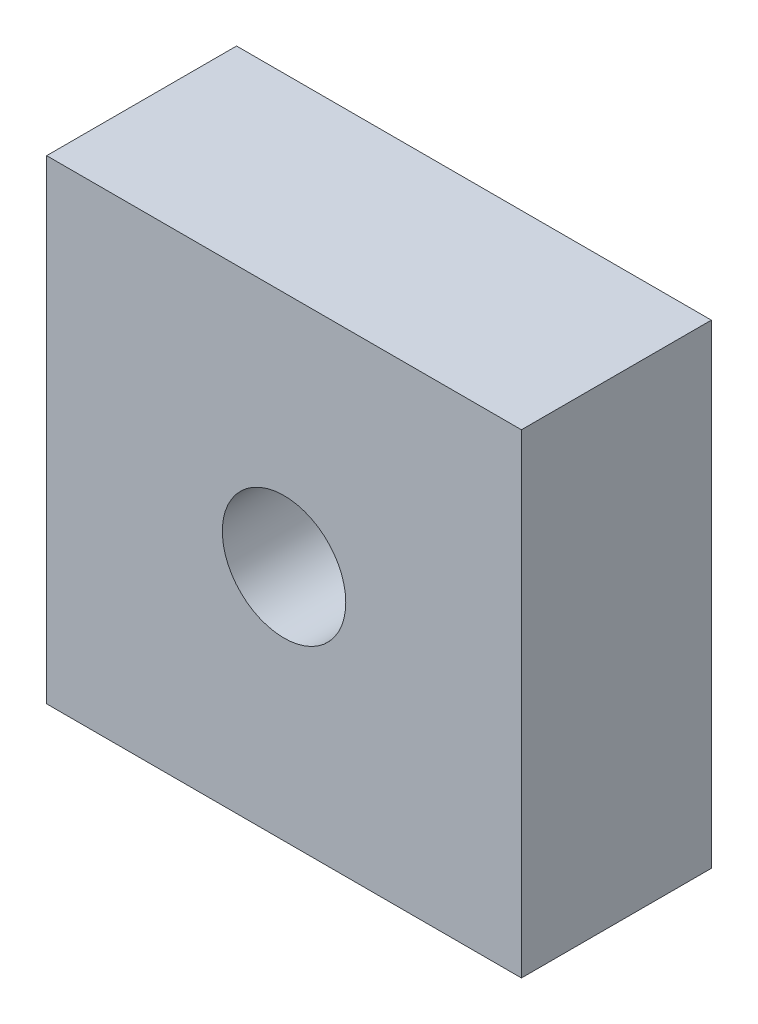
ISO-10303-21;
HEADER;
FILE_DESCRIPTION(('STEP AP214'),'2;1');
FILE_NAME('part.step','',(''),(''),'','','');
FILE_SCHEMA(('AUTOMOTIVE_DESIGN { 1 0 10303 214 1 1 1 1 }'));
ENDSEC;
DATA;
#1=APPLICATION_CONTEXT('core data for automotive mechanical design processes');
#2=APPLICATION_PROTOCOL_DEFINITION('international standard','automotive_design',2000,#1);
#3=PRODUCT_CONTEXT('',#1,'mechanical');
#4=PRODUCT('Part','Part','',(#3));
#5=PRODUCT_RELATED_PRODUCT_CATEGORY('part','',(#4));
#6=PRODUCT_DEFINITION_FORMATION('','',#4);
#7=PRODUCT_DEFINITION_CONTEXT('part definition',#1,'design');
#8=PRODUCT_DEFINITION('design','',#6,#7);
#9=PRODUCT_DEFINITION_SHAPE('','',#8);
#10=(LENGTH_UNIT() NAMED_UNIT(*) SI_UNIT(.MILLI.,.METRE.));
#11=(NAMED_UNIT(*) PLANE_ANGLE_UNIT() SI_UNIT($,.RADIAN.));
#12=(NAMED_UNIT(*) SI_UNIT($,.STERADIAN.) SOLID_ANGLE_UNIT());
#13=UNCERTAINTY_MEASURE_WITH_UNIT(LENGTH_MEASURE(1.E-05),#10,'distance_accuracy_value','');
#14=(GEOMETRIC_REPRESENTATION_CONTEXT(3) GLOBAL_UNCERTAINTY_ASSIGNED_CONTEXT((#13)) GLOBAL_UNIT_ASSIGNED_CONTEXT((#10,
#11,#12)) REPRESENTATION_CONTEXT('',''));
#15=CARTESIAN_POINT('',(0.,0.,0.));
#16=DIRECTION('',(0.,0.,1.));
#17=DIRECTION('',(1.,0.,0.));
#18=AXIS2_PLACEMENT_3D('',#15,#16,#17);
#19=CARTESIAN_POINT('',(0.,0.,6.));
#20=DIRECTION('',(0.,0.,-1.));
#21=DIRECTION('',(-1.,0.,0.));
#22=AXIS2_PLACEMENT_3D('',#19,#20,#21);
#23=PLANE('',#22);
#24=DIRECTION('',(0.,-1.,0.));
#25=VECTOR('',#24,1.);
#26=CARTESIAN_POINT('',(0.,0.,6.));
#27=LINE('',#26,#25);
#28=CARTESIAN_POINT('',(0.,15.,6.));
#29=VERTEX_POINT('',#28);
#30=CARTESIAN_POINT('',(0.,0.,6.));
#31=VERTEX_POINT('',#30);
#32=EDGE_CURVE('E96',#29,#31,#27,.T.);
#33=ORIENTED_EDGE('',*,*,#32,.T.);
#34=DIRECTION('',(1.,0.,0.));
#35=VECTOR('',#34,1.);
#36=CARTESIAN_POINT('',(0.,0.,6.));
#37=LINE('',#36,#35);
#38=CARTESIAN_POINT('',(15.,0.,6.));
#39=VERTEX_POINT('',#38);
#40=EDGE_CURVE('E91',#31,#39,#37,.T.);
#41=ORIENTED_EDGE('',*,*,#40,.T.);
#42=DIRECTION('',(0.,1.,0.));
#43=VECTOR('',#42,1.);
#44=CARTESIAN_POINT('',(15.,0.,6.));
#45=LINE('',#44,#43);
#46=CARTESIAN_POINT('',(15.,15.,6.));
#47=VERTEX_POINT('',#46);
#48=EDGE_CURVE('E94',#39,#47,#45,.T.);
#49=ORIENTED_EDGE('',*,*,#48,.T.);
#50=DIRECTION('',(-1.,0.,0.));
#51=VECTOR('',#50,1.);
#52=CARTESIAN_POINT('',(0.,15.,6.));
#53=LINE('',#52,#51);
#54=EDGE_CURVE('E61',#47,#29,#53,.T.);
#55=ORIENTED_EDGE('',*,*,#54,.T.);
#56=EDGE_LOOP('',(#33,#41,#49,#55));
#57=FACE_BOUND('',#56,.T.);
#58=CARTESIAN_POINT('',(7.5,7.5,6.));
#59=DIRECTION('',(0.,0.,1.));
#60=DIRECTION('',(1.,0.,0.));
#61=AXIS2_PLACEMENT_3D('',#58,#59,#60);
#62=CIRCLE('',#61,1.95);
#63=CARTESIAN_POINT('',(9.45,7.5,6.));
#64=VERTEX_POINT('',#63);
#65=EDGE_CURVE('E116',#64,#64,#62,.T.);
#66=ORIENTED_EDGE('',*,*,#65,.F.);
#67=EDGE_LOOP('',(#66));
#68=FACE_BOUND('',#67,.T.);
#69=ADVANCED_FACE('F43',(#57,#68),#23,.F.);
#70=CARTESIAN_POINT('',(0.,0.,0.));
#71=DIRECTION('',(0.,0.,-1.));
#72=DIRECTION('',(-1.,0.,0.));
#73=AXIS2_PLACEMENT_3D('',#70,#71,#72);
#74=PLANE('',#73);
#75=DIRECTION('',(0.,-1.,0.));
#76=VECTOR('',#75,1.);
#77=CARTESIAN_POINT('',(0.,0.,0.));
#78=LINE('',#77,#76);
#79=CARTESIAN_POINT('',(0.,15.,0.));
#80=VERTEX_POINT('',#79);
#81=CARTESIAN_POINT('',(0.,0.,0.));
#82=VERTEX_POINT('',#81);
#83=EDGE_CURVE('E112',#80,#82,#78,.T.);
#84=ORIENTED_EDGE('',*,*,#83,.F.);
#85=DIRECTION('',(-1.,0.,0.));
#86=VECTOR('',#85,1.);
#87=CARTESIAN_POINT('',(0.,15.,0.));
#88=LINE('',#87,#86);
#89=CARTESIAN_POINT('',(15.,15.,0.));
#90=VERTEX_POINT('',#89);
#91=EDGE_CURVE('E84',#90,#80,#88,.T.);
#92=ORIENTED_EDGE('',*,*,#91,.F.);
#93=DIRECTION('',(0.,1.,0.));
#94=VECTOR('',#93,1.);
#95=CARTESIAN_POINT('',(15.,0.,0.));
#96=LINE('',#95,#94);
#97=CARTESIAN_POINT('',(15.,0.,0.));
#98=VERTEX_POINT('',#97);
#99=EDGE_CURVE('E78',#98,#90,#96,.T.);
#100=ORIENTED_EDGE('',*,*,#99,.F.);
#101=DIRECTION('',(1.,0.,0.));
#102=VECTOR('',#101,1.);
#103=CARTESIAN_POINT('',(0.,0.,0.));
#104=LINE('',#103,#102);
#105=EDGE_CURVE('E101',#82,#98,#104,.T.);
#106=ORIENTED_EDGE('',*,*,#105,.F.);
#107=EDGE_LOOP('',(#84,#92,#100,#106));
#108=FACE_BOUND('',#107,.T.);
#109=CARTESIAN_POINT('',(7.5,7.5,0.));
#110=DIRECTION('',(0.,0.,1.));
#111=DIRECTION('',(1.,0.,0.));
#112=AXIS2_PLACEMENT_3D('',#109,#110,#111);
#113=CIRCLE('',#112,1.95);
#114=CARTESIAN_POINT('',(9.45,7.5,0.));
#115=VERTEX_POINT('',#114);
#116=EDGE_CURVE('E134',#115,#115,#113,.T.);
#117=ORIENTED_EDGE('',*,*,#116,.T.);
#118=EDGE_LOOP('',(#117));
#119=FACE_BOUND('',#118,.T.);
#120=ADVANCED_FACE('F129',(#108,#119),#74,.T.);
#121=CARTESIAN_POINT('',(0.,0.,6.));
#122=DIRECTION('',(1.,0.,0.));
#123=DIRECTION('',(0.,1.,0.));
#124=AXIS2_PLACEMENT_3D('',#121,#122,#123);
#125=PLANE('',#124);
#126=ORIENTED_EDGE('',*,*,#83,.T.);
#127=DIRECTION('',(0.,0.,-1.));
#128=VECTOR('',#127,1.);
#129=CARTESIAN_POINT('',(0.,0.,6.));
#130=LINE('',#129,#128);
#131=EDGE_CURVE('E11',#31,#82,#130,.T.);
#132=ORIENTED_EDGE('',*,*,#131,.F.);
#133=ORIENTED_EDGE('',*,*,#32,.F.);
#134=DIRECTION('',(0.,0.,-1.));
#135=VECTOR('',#134,1.);
#136=CARTESIAN_POINT('',(0.,15.,6.));
#137=LINE('',#136,#135);
#138=EDGE_CURVE('E108',#29,#80,#137,.T.);
#139=ORIENTED_EDGE('',*,*,#138,.T.);
#140=EDGE_LOOP('',(#126,#132,#133,#139));
#141=FACE_BOUND('',#140,.T.);
#142=ADVANCED_FACE('F45',(#141),#125,.F.);
#143=CARTESIAN_POINT('',(0.,0.,6.));
#144=DIRECTION('',(0.,1.,0.));
#145=DIRECTION('',(0.,0.,1.));
#146=AXIS2_PLACEMENT_3D('',#143,#144,#145);
#147=PLANE('',#146);
#148=ORIENTED_EDGE('',*,*,#105,.T.);
#149=DIRECTION('',(0.,0.,-1.));
#150=VECTOR('',#149,1.);
#151=CARTESIAN_POINT('',(15.,0.,6.));
#152=LINE('',#151,#150);
#153=EDGE_CURVE('E53',#39,#98,#152,.T.);
#154=ORIENTED_EDGE('',*,*,#153,.F.);
#155=ORIENTED_EDGE('',*,*,#40,.F.);
#156=ORIENTED_EDGE('',*,*,#131,.T.);
#157=EDGE_LOOP('',(#148,#154,#155,#156));
#158=FACE_BOUND('',#157,.T.);
#159=ADVANCED_FACE('F100',(#158),#147,.F.);
#160=CARTESIAN_POINT('',(15.,0.,6.));
#161=DIRECTION('',(-1.,0.,0.));
#162=DIRECTION('',(0.,-1.,0.));
#163=AXIS2_PLACEMENT_3D('',#160,#161,#162);
#164=PLANE('',#163);
#165=ORIENTED_EDGE('',*,*,#99,.T.);
#166=DIRECTION('',(0.,0.,-1.));
#167=VECTOR('',#166,1.);
#168=CARTESIAN_POINT('',(15.,15.,6.));
#169=LINE('',#168,#167);
#170=EDGE_CURVE('E103',#47,#90,#169,.T.);
#171=ORIENTED_EDGE('',*,*,#170,.F.);
#172=ORIENTED_EDGE('',*,*,#48,.F.);
#173=ORIENTED_EDGE('',*,*,#153,.T.);
#174=EDGE_LOOP('',(#165,#171,#172,#173));
#175=FACE_BOUND('',#174,.T.);
#176=ADVANCED_FACE('F104',(#175),#164,.F.);
#177=CARTESIAN_POINT('',(0.,15.,6.));
#178=DIRECTION('',(0.,-1.,0.));
#179=DIRECTION('',(0.,0.,-1.));
#180=AXIS2_PLACEMENT_3D('',#177,#178,#179);
#181=PLANE('',#180);
#182=ORIENTED_EDGE('',*,*,#91,.T.);
#183=ORIENTED_EDGE('',*,*,#138,.F.);
#184=ORIENTED_EDGE('',*,*,#54,.F.);
#185=ORIENTED_EDGE('',*,*,#170,.T.);
#186=EDGE_LOOP('',(#182,#183,#184,#185));
#187=FACE_BOUND('',#186,.T.);
#188=ADVANCED_FACE('F126',(#187),#181,.F.);
#189=CARTESIAN_POINT('',(7.5,7.5,6.));
#190=DIRECTION('',(0.,0.,-1.));
#191=DIRECTION('',(-1.,0.,0.));
#192=AXIS2_PLACEMENT_3D('',#189,#190,#191);
#193=CYLINDRICAL_SURFACE('',#192,1.95);
#194=ORIENTED_EDGE('',*,*,#65,.T.);
#195=EDGE_LOOP('',(#194));
#196=FACE_BOUND('',#195,.T.);
#197=ORIENTED_EDGE('',*,*,#116,.F.);
#198=EDGE_LOOP('',(#197));
#199=FACE_BOUND('',#198,.T.);
#200=ADVANCED_FACE('F142',(#196,#199),#193,.F.);
#201=CLOSED_SHELL('',(#69,#120,#142,#159,#176,#188,#200));
#202=MANIFOLD_SOLID_BREP('B2',#201);
#203=ADVANCED_BREP_SHAPE_REPRESENTATION('',(#18,#202),#14);
#204=SHAPE_DEFINITION_REPRESENTATION(#9,#203);
ENDSEC;
END-ISO-10303-21;
